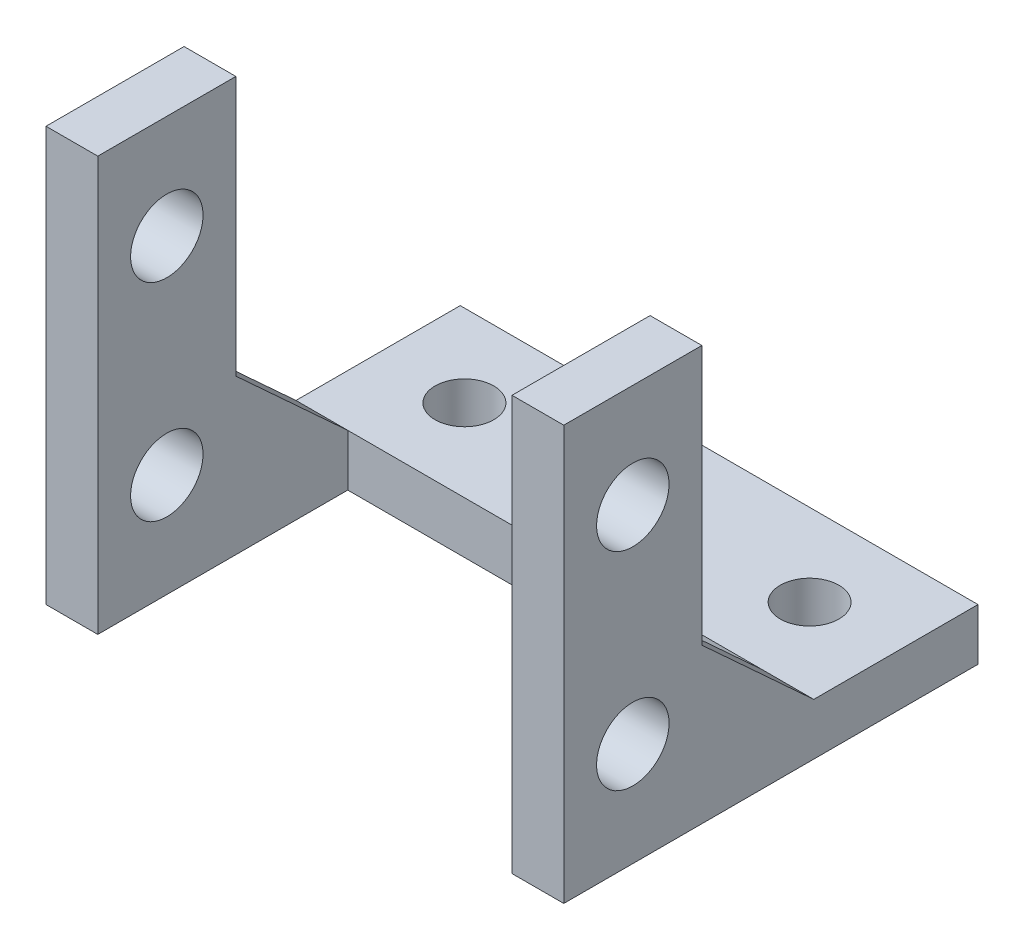
ISO-10303-21;
HEADER;
FILE_DESCRIPTION(('STEP AP214'),'2;1');
FILE_NAME('part.step','',(''),(''),'','','');
FILE_SCHEMA(('AUTOMOTIVE_DESIGN { 1 0 10303 214 1 1 1 1 }'));
ENDSEC;
DATA;
#1=APPLICATION_CONTEXT('core data for automotive mechanical design processes');
#2=APPLICATION_PROTOCOL_DEFINITION('international standard','automotive_design',2000,#1);
#3=PRODUCT_CONTEXT('',#1,'mechanical');
#4=PRODUCT('Part','Part','',(#3));
#5=PRODUCT_RELATED_PRODUCT_CATEGORY('part','',(#4));
#6=PRODUCT_DEFINITION_FORMATION('','',#4);
#7=PRODUCT_DEFINITION_CONTEXT('part definition',#1,'design');
#8=PRODUCT_DEFINITION('design','',#6,#7);
#9=PRODUCT_DEFINITION_SHAPE('','',#8);
#10=(LENGTH_UNIT() NAMED_UNIT(*) SI_UNIT(.MILLI.,.METRE.));
#11=(NAMED_UNIT(*) PLANE_ANGLE_UNIT() SI_UNIT($,.RADIAN.));
#12=(NAMED_UNIT(*) SI_UNIT($,.STERADIAN.) SOLID_ANGLE_UNIT());
#13=UNCERTAINTY_MEASURE_WITH_UNIT(LENGTH_MEASURE(1.E-05),#10,'distance_accuracy_value','');
#14=(GEOMETRIC_REPRESENTATION_CONTEXT(3) GLOBAL_UNCERTAINTY_ASSIGNED_CONTEXT((#13)) GLOBAL_UNIT_ASSIGNED_CONTEXT((#10,
#11,#12)) REPRESENTATION_CONTEXT('',''));
#15=CARTESIAN_POINT('',(0.,0.,0.));
#16=DIRECTION('',(0.,0.,1.));
#17=DIRECTION('',(1.,0.,0.));
#18=AXIS2_PLACEMENT_3D('',#15,#16,#17);
#19=CARTESIAN_POINT('',(15.,24.,0.));
#20=DIRECTION('',(0.,0.,-1.));
#21=DIRECTION('',(-1.,0.,0.));
#22=AXIS2_PLACEMENT_3D('',#19,#20,#21);
#23=PLANE('',#22);
#24=DIRECTION('',(-1.,0.,0.));
#25=VECTOR('',#24,1.);
#26=CARTESIAN_POINT('',(15.,24.,0.));
#27=LINE('',#26,#25);
#28=CARTESIAN_POINT('',(15.,24.,0.));
#29=VERTEX_POINT('',#28);
#30=CARTESIAN_POINT('',(12.,24.,0.));
#31=VERTEX_POINT('',#30);
#32=EDGE_CURVE('E160',#29,#31,#27,.T.);
#33=ORIENTED_EDGE('',*,*,#32,.T.);
#34=DIRECTION('',(0.,1.,0.));
#35=VECTOR('',#34,1.);
#36=CARTESIAN_POINT('',(12.,0.,0.));
#37=LINE('',#36,#35);
#38=CARTESIAN_POINT('',(12.,0.,0.));
#39=VERTEX_POINT('',#38);
#40=EDGE_CURVE('E274',#39,#31,#37,.T.);
#41=ORIENTED_EDGE('',*,*,#40,.F.);
#42=DIRECTION('',(-1.,0.,0.));
#43=VECTOR('',#42,1.);
#44=CARTESIAN_POINT('',(15.,0.,0.));
#45=LINE('',#44,#43);
#46=CARTESIAN_POINT('',(15.,0.,0.));
#47=VERTEX_POINT('',#46);
#48=EDGE_CURVE('E11',#47,#39,#45,.T.);
#49=ORIENTED_EDGE('',*,*,#48,.F.);
#50=DIRECTION('',(0.,-1.,0.));
#51=VECTOR('',#50,1.);
#52=CARTESIAN_POINT('',(15.,24.,0.));
#53=LINE('',#52,#51);
#54=EDGE_CURVE('E159',#29,#47,#53,.T.);
#55=ORIENTED_EDGE('',*,*,#54,.F.);
#56=EDGE_LOOP('',(#33,#41,#49,#55));
#57=FACE_BOUND('',#56,.T.);
#58=ADVANCED_FACE('F33',(#57),#23,.F.);
#59=CARTESIAN_POINT('',(15.,8.96093680674537,-8.));
#60=DIRECTION('',(0.,-0.736172141731038,0.676794339322617));
#61=DIRECTION('',(0.,-0.676794339322617,-0.736172141731038));
#62=AXIS2_PLACEMENT_3D('',#59,#60,#61);
#63=PLANE('',#62);
#64=DIRECTION('',(-1.,0.,0.));
#65=VECTOR('',#64,1.);
#66=CARTESIAN_POINT('',(15.,3.,-14.4839130010118));
#67=LINE('',#66,#65);
#68=CARTESIAN_POINT('',(15.,3.,-14.4839130010118));
#69=VERTEX_POINT('',#68);
#70=CARTESIAN_POINT('',(12.,3.,-14.4839130010118));
#71=VERTEX_POINT('',#70);
#72=EDGE_CURVE('E165',#69,#71,#67,.T.);
#73=ORIENTED_EDGE('',*,*,#72,.T.);
#74=DIRECTION('',(0.,0.676794339322617,0.736172141731038));
#75=VECTOR('',#74,1.);
#76=CARTESIAN_POINT('',(12.,8.96093680674537,-8.));
#77=LINE('',#76,#75);
#78=CARTESIAN_POINT('',(12.,8.96093680674537,-8.));
#79=VERTEX_POINT('',#78);
#80=EDGE_CURVE('E128',#71,#79,#77,.T.);
#81=ORIENTED_EDGE('',*,*,#80,.T.);
#82=DIRECTION('',(-1.,0.,0.));
#83=VECTOR('',#82,1.);
#84=CARTESIAN_POINT('',(15.,8.96093680674537,-8.));
#85=LINE('',#84,#83);
#86=CARTESIAN_POINT('',(15.,8.96093680674537,-8.));
#87=VERTEX_POINT('',#86);
#88=EDGE_CURVE('E125',#87,#79,#85,.T.);
#89=ORIENTED_EDGE('',*,*,#88,.F.);
#90=DIRECTION('',(0.,0.676794339322617,0.736172141731038));
#91=VECTOR('',#90,1.);
#92=CARTESIAN_POINT('',(15.,8.96093680674537,-8.));
#93=LINE('',#92,#91);
#94=EDGE_CURVE('E110',#69,#87,#93,.T.);
#95=ORIENTED_EDGE('',*,*,#94,.F.);
#96=EDGE_LOOP('',(#73,#81,#89,#95));
#97=FACE_BOUND('',#96,.T.);
#98=ADVANCED_FACE('F126',(#97),#63,.F.);
#99=CARTESIAN_POINT('',(15.,24.,-8.));
#100=DIRECTION('',(0.,0.,1.));
#101=DIRECTION('',(0.,-1.,0.));
#102=AXIS2_PLACEMENT_3D('',#99,#100,#101);
#103=PLANE('',#102);
#104=ORIENTED_EDGE('',*,*,#88,.T.);
#105=DIRECTION('',(0.,1.,0.));
#106=VECTOR('',#105,1.);
#107=CARTESIAN_POINT('',(12.,24.,-8.));
#108=LINE('',#107,#106);
#109=CARTESIAN_POINT('',(12.,24.,-8.));
#110=VERTEX_POINT('',#109);
#111=EDGE_CURVE('E209',#79,#110,#108,.T.);
#112=ORIENTED_EDGE('',*,*,#111,.T.);
#113=DIRECTION('',(-1.,0.,0.));
#114=VECTOR('',#113,1.);
#115=CARTESIAN_POINT('',(15.,24.,-8.));
#116=LINE('',#115,#114);
#117=CARTESIAN_POINT('',(15.,24.,-8.));
#118=VERTEX_POINT('',#117);
#119=EDGE_CURVE('E136',#118,#110,#116,.T.);
#120=ORIENTED_EDGE('',*,*,#119,.F.);
#121=DIRECTION('',(0.,1.,0.));
#122=VECTOR('',#121,1.);
#123=CARTESIAN_POINT('',(15.,24.,-8.));
#124=LINE('',#123,#122);
#125=EDGE_CURVE('E115',#87,#118,#124,.T.);
#126=ORIENTED_EDGE('',*,*,#125,.F.);
#127=EDGE_LOOP('',(#104,#112,#120,#126));
#128=FACE_BOUND('',#127,.T.);
#129=ADVANCED_FACE('F134',(#128),#103,.F.);
#130=CARTESIAN_POINT('',(15.,24.,-8.));
#131=DIRECTION('',(0.,-1.,0.));
#132=DIRECTION('',(0.,0.,-1.));
#133=AXIS2_PLACEMENT_3D('',#130,#131,#132);
#134=PLANE('',#133);
#135=ORIENTED_EDGE('',*,*,#119,.T.);
#136=DIRECTION('',(0.,0.,1.));
#137=VECTOR('',#136,1.);
#138=CARTESIAN_POINT('',(12.,24.,-14.4839130010118));
#139=LINE('',#138,#137);
#140=EDGE_CURVE('E198',#110,#31,#139,.T.);
#141=ORIENTED_EDGE('',*,*,#140,.T.);
#142=ORIENTED_EDGE('',*,*,#32,.F.);
#143=DIRECTION('',(0.,0.,1.));
#144=VECTOR('',#143,1.);
#145=CARTESIAN_POINT('',(15.,24.,-8.));
#146=LINE('',#145,#144);
#147=EDGE_CURVE('E59',#118,#29,#146,.T.);
#148=ORIENTED_EDGE('',*,*,#147,.F.);
#149=EDGE_LOOP('',(#135,#141,#142,#148));
#150=FACE_BOUND('',#149,.T.);
#151=ADVANCED_FACE('F335',(#150),#134,.F.);
#152=CARTESIAN_POINT('',(15.,6.,-4.));
#153=DIRECTION('',(-1.,0.,0.));
#154=DIRECTION('',(0.,0.,1.));
#155=AXIS2_PLACEMENT_3D('',#152,#153,#154);
#156=CYLINDRICAL_SURFACE('',#155,2.1);
#157=CARTESIAN_POINT('',(12.,6.,-4.));
#158=DIRECTION('',(1.,0.,0.));
#159=DIRECTION('',(0.,0.,-1.));
#160=AXIS2_PLACEMENT_3D('',#157,#158,#159);
#161=CIRCLE('',#160,2.1);
#162=CARTESIAN_POINT('',(12.,6.,-6.1));
#163=VERTEX_POINT('',#162);
#164=EDGE_CURVE('E206',#163,#163,#161,.T.);
#165=ORIENTED_EDGE('',*,*,#164,.F.);
#166=EDGE_LOOP('',(#165));
#167=FACE_BOUND('',#166,.T.);
#168=CARTESIAN_POINT('',(15.,6.,-4.));
#169=DIRECTION('',(1.,0.,0.));
#170=DIRECTION('',(0.,0.,-1.));
#171=AXIS2_PLACEMENT_3D('',#168,#169,#170);
#172=CIRCLE('',#171,2.1);
#173=CARTESIAN_POINT('',(15.,6.,-6.1));
#174=VERTEX_POINT('',#173);
#175=EDGE_CURVE('E144',#174,#174,#172,.T.);
#176=ORIENTED_EDGE('',*,*,#175,.T.);
#177=EDGE_LOOP('',(#176));
#178=FACE_BOUND('',#177,.T.);
#179=ADVANCED_FACE('F342',(#167,#178),#156,.F.);
#180=CARTESIAN_POINT('',(15.,18.,-4.));
#181=DIRECTION('',(-1.,0.,0.));
#182=DIRECTION('',(0.,0.,1.));
#183=AXIS2_PLACEMENT_3D('',#180,#181,#182);
#184=CYLINDRICAL_SURFACE('',#183,2.1);
#185=CARTESIAN_POINT('',(12.,18.,-4.));
#186=DIRECTION('',(1.,0.,0.));
#187=DIRECTION('',(0.,0.,-1.));
#188=AXIS2_PLACEMENT_3D('',#185,#186,#187);
#189=CIRCLE('',#188,2.1);
#190=CARTESIAN_POINT('',(12.,18.,-6.1));
#191=VERTEX_POINT('',#190);
#192=EDGE_CURVE('E37',#191,#191,#189,.T.);
#193=ORIENTED_EDGE('',*,*,#192,.F.);
#194=EDGE_LOOP('',(#193));
#195=FACE_BOUND('',#194,.T.);
#196=CARTESIAN_POINT('',(15.,18.,-4.));
#197=DIRECTION('',(1.,0.,0.));
#198=DIRECTION('',(0.,0.,1.));
#199=AXIS2_PLACEMENT_3D('',#196,#197,#198);
#200=CIRCLE('',#199,2.1);
#201=CARTESIAN_POINT('',(15.,18.,-1.9));
#202=VERTEX_POINT('',#201);
#203=EDGE_CURVE('E213',#202,#202,#200,.T.);
#204=ORIENTED_EDGE('',*,*,#203,.T.);
#205=EDGE_LOOP('',(#204));
#206=FACE_BOUND('',#205,.T.);
#207=ADVANCED_FACE('F350',(#195,#206),#184,.F.);
#208=CARTESIAN_POINT('',(15.,0.,0.));
#209=DIRECTION('',(1.,0.,0.));
#210=DIRECTION('',(0.,0.,-1.));
#211=AXIS2_PLACEMENT_3D('',#208,#209,#210);
#212=PLANE('',#211);
#213=ORIENTED_EDGE('',*,*,#175,.F.);
#214=EDGE_LOOP('',(#213));
#215=FACE_BOUND('',#214,.T.);
#216=ORIENTED_EDGE('',*,*,#54,.T.);
#217=DIRECTION('',(0.,0.,-1.));
#218=VECTOR('',#217,1.);
#219=CARTESIAN_POINT('',(15.,0.,0.));
#220=LINE('',#219,#218);
#221=CARTESIAN_POINT('',(15.,0.,-24.));
#222=VERTEX_POINT('',#221);
#223=EDGE_CURVE('E98',#47,#222,#220,.T.);
#224=ORIENTED_EDGE('',*,*,#223,.T.);
#225=DIRECTION('',(0.,1.,0.));
#226=VECTOR('',#225,1.);
#227=CARTESIAN_POINT('',(15.,0.,-24.));
#228=LINE('',#227,#226);
#229=CARTESIAN_POINT('',(15.,3.,-24.));
#230=VERTEX_POINT('',#229);
#231=EDGE_CURVE('E225',#222,#230,#228,.T.);
#232=ORIENTED_EDGE('',*,*,#231,.T.);
#233=DIRECTION('',(0.,0.,1.));
#234=VECTOR('',#233,1.);
#235=CARTESIAN_POINT('',(15.,3.,-14.4839130010118));
#236=LINE('',#235,#234);
#237=EDGE_CURVE('E118',#230,#69,#236,.T.);
#238=ORIENTED_EDGE('',*,*,#237,.T.);
#239=ORIENTED_EDGE('',*,*,#94,.T.);
#240=ORIENTED_EDGE('',*,*,#125,.T.);
#241=ORIENTED_EDGE('',*,*,#147,.T.);
#242=EDGE_LOOP('',(#216,#224,#232,#238,#239,#240,#241));
#243=FACE_BOUND('',#242,.T.);
#244=ORIENTED_EDGE('',*,*,#203,.F.);
#245=EDGE_LOOP('',(#244));
#246=FACE_BOUND('',#245,.T.);
#247=ADVANCED_FACE('F112',(#215,#243,#246),#212,.T.);
#248=CARTESIAN_POINT('',(-15.,0.,0.));
#249=DIRECTION('',(1.,0.,0.));
#250=DIRECTION('',(0.,0.,-1.));
#251=AXIS2_PLACEMENT_3D('',#248,#249,#250);
#252=PLANE('',#251);
#253=DIRECTION('',(0.,-1.,0.));
#254=VECTOR('',#253,1.);
#255=CARTESIAN_POINT('',(-15.,24.,0.));
#256=LINE('',#255,#254);
#257=CARTESIAN_POINT('',(-15.,24.,0.));
#258=VERTEX_POINT('',#257);
#259=CARTESIAN_POINT('',(-15.,0.,0.));
#260=VERTEX_POINT('',#259);
#261=EDGE_CURVE('E141',#258,#260,#256,.T.);
#262=ORIENTED_EDGE('',*,*,#261,.F.);
#263=DIRECTION('',(0.,0.,1.));
#264=VECTOR('',#263,1.);
#265=CARTESIAN_POINT('',(-15.,24.,-8.));
#266=LINE('',#265,#264);
#267=CARTESIAN_POINT('',(-15.,24.,-8.));
#268=VERTEX_POINT('',#267);
#269=EDGE_CURVE('E157',#268,#258,#266,.T.);
#270=ORIENTED_EDGE('',*,*,#269,.F.);
#271=DIRECTION('',(0.,1.,0.));
#272=VECTOR('',#271,1.);
#273=CARTESIAN_POINT('',(-15.,24.,-8.));
#274=LINE('',#273,#272);
#275=CARTESIAN_POINT('',(-15.,8.96093680674537,-8.));
#276=VERTEX_POINT('',#275);
#277=EDGE_CURVE('E154',#276,#268,#274,.T.);
#278=ORIENTED_EDGE('',*,*,#277,.F.);
#279=DIRECTION('',(0.,0.676794339322617,0.736172141731038));
#280=VECTOR('',#279,1.);
#281=CARTESIAN_POINT('',(-15.,8.96093680674537,-8.));
#282=LINE('',#281,#280);
#283=CARTESIAN_POINT('',(-15.,3.,-14.4839130010118));
#284=VERTEX_POINT('',#283);
#285=EDGE_CURVE('E151',#284,#276,#282,.T.);
#286=ORIENTED_EDGE('',*,*,#285,.F.);
#287=DIRECTION('',(0.,0.,1.));
#288=VECTOR('',#287,1.);
#289=CARTESIAN_POINT('',(-15.,3.,-14.4839130010118));
#290=LINE('',#289,#288);
#291=CARTESIAN_POINT('',(-15.,3.,-24.));
#292=VERTEX_POINT('',#291);
#293=EDGE_CURVE('E148',#292,#284,#290,.T.);
#294=ORIENTED_EDGE('',*,*,#293,.F.);
#295=DIRECTION('',(0.,1.,0.));
#296=VECTOR('',#295,1.);
#297=CARTESIAN_POINT('',(-15.,0.,-24.));
#298=LINE('',#297,#296);
#299=CARTESIAN_POINT('',(-15.,0.,-24.));
#300=VERTEX_POINT('',#299);
#301=EDGE_CURVE('E146',#300,#292,#298,.T.);
#302=ORIENTED_EDGE('',*,*,#301,.F.);
#303=DIRECTION('',(0.,0.,-1.));
#304=VECTOR('',#303,1.);
#305=CARTESIAN_POINT('',(-15.,0.,0.));
#306=LINE('',#305,#304);
#307=EDGE_CURVE('E143',#260,#300,#306,.T.);
#308=ORIENTED_EDGE('',*,*,#307,.F.);
#309=EDGE_LOOP('',(#262,#270,#278,#286,#294,#302,#308));
#310=FACE_BOUND('',#309,.T.);
#311=CARTESIAN_POINT('',(-15.,6.,-4.));
#312=DIRECTION('',(1.,0.,0.));
#313=DIRECTION('',(0.,0.,-1.));
#314=AXIS2_PLACEMENT_3D('',#311,#312,#313);
#315=CIRCLE('',#314,2.1);
#316=CARTESIAN_POINT('',(-15.,6.,-6.1));
#317=VERTEX_POINT('',#316);
#318=EDGE_CURVE('E216',#317,#317,#315,.T.);
#319=ORIENTED_EDGE('',*,*,#318,.T.);
#320=EDGE_LOOP('',(#319));
#321=FACE_BOUND('',#320,.T.);
#322=CARTESIAN_POINT('',(-15.,18.,-4.));
#323=DIRECTION('',(1.,0.,0.));
#324=DIRECTION('',(0.,0.,1.));
#325=AXIS2_PLACEMENT_3D('',#322,#323,#324);
#326=CIRCLE('',#325,2.1);
#327=CARTESIAN_POINT('',(-15.,18.,-1.9));
#328=VERTEX_POINT('',#327);
#329=EDGE_CURVE('E212',#328,#328,#326,.T.);
#330=ORIENTED_EDGE('',*,*,#329,.T.);
#331=EDGE_LOOP('',(#330));
#332=FACE_BOUND('',#331,.T.);
#333=ADVANCED_FACE('F312',(#310,#321,#332),#252,.F.);
#334=CARTESIAN_POINT('',(-12.,0.,0.));
#335=VERTEX_POINT('',#334);
#336=EDGE_CURVE('E42',#335,#260,#45,.T.);
#337=ORIENTED_EDGE('',*,*,#336,.F.);
#338=DIRECTION('',(0.,-1.,0.));
#339=VECTOR('',#338,1.);
#340=CARTESIAN_POINT('',(-12.,0.,0.));
#341=LINE('',#340,#339);
#342=CARTESIAN_POINT('',(-12.,24.,0.));
#343=VERTEX_POINT('',#342);
#344=EDGE_CURVE('E194',#343,#335,#341,.T.);
#345=ORIENTED_EDGE('',*,*,#344,.F.);
#346=EDGE_CURVE('E90',#343,#258,#27,.T.);
#347=ORIENTED_EDGE('',*,*,#346,.T.);
#348=ORIENTED_EDGE('',*,*,#261,.T.);
#349=EDGE_LOOP('',(#337,#345,#347,#348));
#350=FACE_BOUND('',#349,.T.);
#351=ADVANCED_FACE('F35',(#350),#23,.F.);
#352=CARTESIAN_POINT('',(15.,0.,0.));
#353=DIRECTION('',(0.,1.,0.));
#354=DIRECTION('',(0.,0.,1.));
#355=AXIS2_PLACEMENT_3D('',#352,#353,#354);
#356=PLANE('',#355);
#357=CARTESIAN_POINT('',(-10.,0.,-19.2419565005059));
#358=DIRECTION('',(0.,1.,0.));
#359=DIRECTION('',(0.,0.,1.));
#360=AXIS2_PLACEMENT_3D('',#357,#358,#359);
#361=CIRCLE('',#360,1.7);
#362=CARTESIAN_POINT('',(-10.,0.,-17.5419565005059));
#363=VERTEX_POINT('',#362);
#364=EDGE_CURVE('E275',#363,#363,#361,.T.);
#365=ORIENTED_EDGE('',*,*,#364,.T.);
#366=EDGE_LOOP('',(#365));
#367=FACE_BOUND('',#366,.T.);
#368=CARTESIAN_POINT('',(10.,0.,-19.2419565005059));
#369=DIRECTION('',(0.,1.,0.));
#370=DIRECTION('',(0.,0.,-1.));
#371=AXIS2_PLACEMENT_3D('',#368,#369,#370);
#372=CIRCLE('',#371,1.7);
#373=CARTESIAN_POINT('',(10.,0.,-20.9419565005059));
#374=VERTEX_POINT('',#373);
#375=EDGE_CURVE('E282',#374,#374,#372,.T.);
#376=ORIENTED_EDGE('',*,*,#375,.T.);
#377=EDGE_LOOP('',(#376));
#378=FACE_BOUND('',#377,.T.);
#379=ORIENTED_EDGE('',*,*,#48,.T.);
#380=DIRECTION('',(0.,0.,1.));
#381=VECTOR('',#380,1.);
#382=CARTESIAN_POINT('',(12.,0.,-14.4839130010118));
#383=LINE('',#382,#381);
#384=CARTESIAN_POINT('',(12.,0.,-14.4839130010118));
#385=VERTEX_POINT('',#384);
#386=EDGE_CURVE('E176',#385,#39,#383,.T.);
#387=ORIENTED_EDGE('',*,*,#386,.F.);
#388=DIRECTION('',(1.,0.,0.));
#389=VECTOR('',#388,1.);
#390=CARTESIAN_POINT('',(-12.,0.,-14.4839130010118));
#391=LINE('',#390,#389);
#392=CARTESIAN_POINT('',(-12.,0.,-14.4839130010118));
#393=VERTEX_POINT('',#392);
#394=EDGE_CURVE('E200',#393,#385,#391,.T.);
#395=ORIENTED_EDGE('',*,*,#394,.F.);
#396=DIRECTION('',(0.,0.,1.));
#397=VECTOR('',#396,1.);
#398=CARTESIAN_POINT('',(-12.,0.,-14.4839130010118));
#399=LINE('',#398,#397);
#400=EDGE_CURVE('E182',#393,#335,#399,.T.);
#401=ORIENTED_EDGE('',*,*,#400,.T.);
#402=ORIENTED_EDGE('',*,*,#336,.T.);
#403=ORIENTED_EDGE('',*,*,#307,.T.);
#404=DIRECTION('',(-1.,0.,0.));
#405=VECTOR('',#404,1.);
#406=CARTESIAN_POINT('',(15.,0.,-24.));
#407=LINE('',#406,#405);
#408=EDGE_CURVE('E171',#222,#300,#407,.T.);
#409=ORIENTED_EDGE('',*,*,#408,.F.);
#410=ORIENTED_EDGE('',*,*,#223,.F.);
#411=EDGE_LOOP('',(#379,#387,#395,#401,#402,#403,#409,#410));
#412=FACE_BOUND('',#411,.T.);
#413=ADVANCED_FACE('F271',(#367,#378,#412),#356,.F.);
#414=CARTESIAN_POINT('',(15.,0.,-24.));
#415=DIRECTION('',(0.,0.,1.));
#416=DIRECTION('',(1.,0.,0.));
#417=AXIS2_PLACEMENT_3D('',#414,#415,#416);
#418=PLANE('',#417);
#419=ORIENTED_EDGE('',*,*,#301,.T.);
#420=DIRECTION('',(-1.,0.,0.));
#421=VECTOR('',#420,1.);
#422=CARTESIAN_POINT('',(15.,3.,-24.));
#423=LINE('',#422,#421);
#424=EDGE_CURVE('E167',#230,#292,#423,.T.);
#425=ORIENTED_EDGE('',*,*,#424,.F.);
#426=ORIENTED_EDGE('',*,*,#231,.F.);
#427=ORIENTED_EDGE('',*,*,#408,.T.);
#428=EDGE_LOOP('',(#419,#425,#426,#427));
#429=FACE_BOUND('',#428,.T.);
#430=ADVANCED_FACE('F229',(#429),#418,.F.);
#431=CARTESIAN_POINT('',(15.,3.,-14.4839130010118));
#432=DIRECTION('',(0.,-1.,0.));
#433=DIRECTION('',(0.,0.,-1.));
#434=AXIS2_PLACEMENT_3D('',#431,#432,#433);
#435=PLANE('',#434);
#436=CARTESIAN_POINT('',(-10.,3.,-19.2419565005059));
#437=DIRECTION('',(0.,-1.,0.));
#438=DIRECTION('',(0.,0.,-1.));
#439=AXIS2_PLACEMENT_3D('',#436,#437,#438);
#440=CIRCLE('',#439,1.7);
#441=CARTESIAN_POINT('',(-10.,3.,-20.9419565005059));
#442=VERTEX_POINT('',#441);
#443=EDGE_CURVE('E277',#442,#442,#440,.T.);
#444=ORIENTED_EDGE('',*,*,#443,.T.);
#445=EDGE_LOOP('',(#444));
#446=FACE_BOUND('',#445,.T.);
#447=CARTESIAN_POINT('',(10.,3.,-19.2419565005059));
#448=DIRECTION('',(0.,-1.,0.));
#449=DIRECTION('',(0.,0.,-1.));
#450=AXIS2_PLACEMENT_3D('',#447,#448,#449);
#451=CIRCLE('',#450,1.7);
#452=CARTESIAN_POINT('',(10.,3.,-20.9419565005059));
#453=VERTEX_POINT('',#452);
#454=EDGE_CURVE('E287',#453,#453,#451,.T.);
#455=ORIENTED_EDGE('',*,*,#454,.T.);
#456=EDGE_LOOP('',(#455));
#457=FACE_BOUND('',#456,.T.);
#458=ORIENTED_EDGE('',*,*,#293,.T.);
#459=CARTESIAN_POINT('',(-12.,3.,-14.4839130010118));
#460=VERTEX_POINT('',#459);
#461=EDGE_CURVE('E131',#460,#284,#67,.T.);
#462=ORIENTED_EDGE('',*,*,#461,.F.);
#463=EDGE_CURVE('E168',#71,#460,#67,.T.);
#464=ORIENTED_EDGE('',*,*,#463,.F.);
#465=ORIENTED_EDGE('',*,*,#72,.F.);
#466=ORIENTED_EDGE('',*,*,#237,.F.);
#467=ORIENTED_EDGE('',*,*,#424,.T.);
#468=EDGE_LOOP('',(#458,#462,#464,#465,#466,#467));
#469=FACE_BOUND('',#468,.T.);
#470=ADVANCED_FACE('F233',(#446,#457,#469),#435,.F.);
#471=CARTESIAN_POINT('',(-12.,8.96093680674537,-8.));
#472=VERTEX_POINT('',#471);
#473=EDGE_CURVE('E132',#472,#276,#85,.T.);
#474=ORIENTED_EDGE('',*,*,#473,.F.);
#475=DIRECTION('',(0.,-0.676794339322617,-0.736172141731038));
#476=VECTOR('',#475,1.);
#477=CARTESIAN_POINT('',(-12.,8.96093680674537,-8.));
#478=LINE('',#477,#476);
#479=EDGE_CURVE('E203',#472,#460,#478,.T.);
#480=ORIENTED_EDGE('',*,*,#479,.T.);
#481=ORIENTED_EDGE('',*,*,#461,.T.);
#482=ORIENTED_EDGE('',*,*,#285,.T.);
#483=EDGE_LOOP('',(#474,#480,#481,#482));
#484=FACE_BOUND('',#483,.T.);
#485=ADVANCED_FACE('F310',(#484),#63,.F.);
#486=CARTESIAN_POINT('',(-12.,24.,-8.));
#487=VERTEX_POINT('',#486);
#488=EDGE_CURVE('E163',#487,#268,#116,.T.);
#489=ORIENTED_EDGE('',*,*,#488,.F.);
#490=DIRECTION('',(0.,-1.,0.));
#491=VECTOR('',#490,1.);
#492=CARTESIAN_POINT('',(-12.,24.,-8.));
#493=LINE('',#492,#491);
#494=EDGE_CURVE('E50',#487,#472,#493,.T.);
#495=ORIENTED_EDGE('',*,*,#494,.T.);
#496=ORIENTED_EDGE('',*,*,#473,.T.);
#497=ORIENTED_EDGE('',*,*,#277,.T.);
#498=EDGE_LOOP('',(#489,#495,#496,#497));
#499=FACE_BOUND('',#498,.T.);
#500=ADVANCED_FACE('F329',(#499),#103,.F.);
#501=ORIENTED_EDGE('',*,*,#346,.F.);
#502=DIRECTION('',(0.,0.,1.));
#503=VECTOR('',#502,1.);
#504=CARTESIAN_POINT('',(-12.,24.,-14.4839130010118));
#505=LINE('',#504,#503);
#506=EDGE_CURVE('E191',#487,#343,#505,.T.);
#507=ORIENTED_EDGE('',*,*,#506,.F.);
#508=ORIENTED_EDGE('',*,*,#488,.T.);
#509=ORIENTED_EDGE('',*,*,#269,.T.);
#510=EDGE_LOOP('',(#501,#507,#508,#509));
#511=FACE_BOUND('',#510,.T.);
#512=ADVANCED_FACE('F331',(#511),#134,.F.);
#513=CARTESIAN_POINT('',(-12.,6.,-4.));
#514=DIRECTION('',(-1.,0.,0.));
#515=DIRECTION('',(0.,0.,1.));
#516=AXIS2_PLACEMENT_3D('',#513,#514,#515);
#517=CIRCLE('',#516,2.1);
#518=CARTESIAN_POINT('',(-12.,6.,-1.9));
#519=VERTEX_POINT('',#518);
#520=EDGE_CURVE('E175',#519,#519,#517,.T.);
#521=ORIENTED_EDGE('',*,*,#520,.F.);
#522=EDGE_LOOP('',(#521));
#523=FACE_BOUND('',#522,.T.);
#524=ORIENTED_EDGE('',*,*,#318,.F.);
#525=EDGE_LOOP('',(#524));
#526=FACE_BOUND('',#525,.T.);
#527=ADVANCED_FACE('F333',(#523,#526),#156,.F.);
#528=CARTESIAN_POINT('',(-12.,18.,-4.));
#529=DIRECTION('',(-1.,0.,0.));
#530=DIRECTION('',(0.,0.,1.));
#531=AXIS2_PLACEMENT_3D('',#528,#529,#530);
#532=CIRCLE('',#531,2.1);
#533=CARTESIAN_POINT('',(-12.,18.,-1.9));
#534=VERTEX_POINT('',#533);
#535=EDGE_CURVE('E173',#534,#534,#532,.T.);
#536=ORIENTED_EDGE('',*,*,#535,.F.);
#537=EDGE_LOOP('',(#536));
#538=FACE_BOUND('',#537,.T.);
#539=ORIENTED_EDGE('',*,*,#329,.F.);
#540=EDGE_LOOP('',(#539));
#541=FACE_BOUND('',#540,.T.);
#542=ADVANCED_FACE('F300',(#538,#541),#184,.F.);
#543=CARTESIAN_POINT('',(0.,0.,-14.4839130010118));
#544=DIRECTION('',(0.,0.,-1.));
#545=DIRECTION('',(-1.,0.,0.));
#546=AXIS2_PLACEMENT_3D('',#543,#544,#545);
#547=PLANE('',#546);
#548=DIRECTION('',(0.,-1.,0.));
#549=VECTOR('',#548,1.);
#550=CARTESIAN_POINT('',(-12.,0.,-14.4839130010118));
#551=LINE('',#550,#549);
#552=EDGE_CURVE('E263',#460,#393,#551,.T.);
#553=ORIENTED_EDGE('',*,*,#552,.T.);
#554=ORIENTED_EDGE('',*,*,#394,.T.);
#555=DIRECTION('',(0.,1.,0.));
#556=VECTOR('',#555,1.);
#557=CARTESIAN_POINT('',(12.,0.,-14.4839130010118));
#558=LINE('',#557,#556);
#559=EDGE_CURVE('E267',#385,#71,#558,.T.);
#560=ORIENTED_EDGE('',*,*,#559,.T.);
#561=ORIENTED_EDGE('',*,*,#463,.T.);
#562=EDGE_LOOP('',(#553,#554,#560,#561));
#563=FACE_BOUND('',#562,.T.);
#564=ADVANCED_FACE('F265',(#563),#547,.F.);
#565=CARTESIAN_POINT('',(12.,0.,-14.4839130010118));
#566=DIRECTION('',(1.,0.,0.));
#567=DIRECTION('',(0.,0.,-1.));
#568=AXIS2_PLACEMENT_3D('',#565,#566,#567);
#569=PLANE('',#568);
#570=ORIENTED_EDGE('',*,*,#164,.T.);
#571=EDGE_LOOP('',(#570));
#572=FACE_BOUND('',#571,.T.);
#573=ORIENTED_EDGE('',*,*,#192,.T.);
#574=EDGE_LOOP('',(#573));
#575=FACE_BOUND('',#574,.T.);
#576=ORIENTED_EDGE('',*,*,#559,.F.);
#577=ORIENTED_EDGE('',*,*,#386,.T.);
#578=ORIENTED_EDGE('',*,*,#40,.T.);
#579=ORIENTED_EDGE('',*,*,#140,.F.);
#580=ORIENTED_EDGE('',*,*,#111,.F.);
#581=ORIENTED_EDGE('',*,*,#80,.F.);
#582=EDGE_LOOP('',(#576,#577,#578,#579,#580,#581));
#583=FACE_BOUND('',#582,.T.);
#584=ADVANCED_FACE('F289',(#572,#575,#583),#569,.F.);
#585=CARTESIAN_POINT('',(-12.,0.,-14.4839130010118));
#586=DIRECTION('',(-1.,0.,0.));
#587=DIRECTION('',(0.,0.,1.));
#588=AXIS2_PLACEMENT_3D('',#585,#586,#587);
#589=PLANE('',#588);
#590=ORIENTED_EDGE('',*,*,#520,.T.);
#591=EDGE_LOOP('',(#590));
#592=FACE_BOUND('',#591,.T.);
#593=ORIENTED_EDGE('',*,*,#535,.T.);
#594=EDGE_LOOP('',(#593));
#595=FACE_BOUND('',#594,.T.);
#596=ORIENTED_EDGE('',*,*,#494,.F.);
#597=ORIENTED_EDGE('',*,*,#506,.T.);
#598=ORIENTED_EDGE('',*,*,#344,.T.);
#599=ORIENTED_EDGE('',*,*,#400,.F.);
#600=ORIENTED_EDGE('',*,*,#552,.F.);
#601=ORIENTED_EDGE('',*,*,#479,.F.);
#602=EDGE_LOOP('',(#596,#597,#598,#599,#600,#601));
#603=FACE_BOUND('',#602,.T.);
#604=ADVANCED_FACE('F269',(#592,#595,#603),#589,.F.);
#605=CARTESIAN_POINT('',(10.,24.001,-19.2419565005059));
#606=DIRECTION('',(0.,-1.,0.));
#607=DIRECTION('',(0.,0.,-1.));
#608=AXIS2_PLACEMENT_3D('',#605,#606,#607);
#609=CYLINDRICAL_SURFACE('',#608,1.7);
#610=ORIENTED_EDGE('',*,*,#375,.F.);
#611=EDGE_LOOP('',(#610));
#612=FACE_BOUND('',#611,.T.);
#613=ORIENTED_EDGE('',*,*,#454,.F.);
#614=EDGE_LOOP('',(#613));
#615=FACE_BOUND('',#614,.T.);
#616=ADVANCED_FACE('F297',(#612,#615),#609,.F.);
#617=CARTESIAN_POINT('',(-10.,24.001,-19.2419565005059));
#618=DIRECTION('',(0.,-1.,0.));
#619=DIRECTION('',(0.,0.,-1.));
#620=AXIS2_PLACEMENT_3D('',#617,#618,#619);
#621=CYLINDRICAL_SURFACE('',#620,1.7);
#622=ORIENTED_EDGE('',*,*,#364,.F.);
#623=EDGE_LOOP('',(#622));
#624=FACE_BOUND('',#623,.T.);
#625=ORIENTED_EDGE('',*,*,#443,.F.);
#626=EDGE_LOOP('',(#625));
#627=FACE_BOUND('',#626,.T.);
#628=ADVANCED_FACE('F488',(#624,#627),#621,.F.);
#629=CLOSED_SHELL('',(#58,#98,#129,#151,#179,#207,#247,#333,#351,#413,#430,#470,#485,#500,#512,
#527,#542,#564,#584,#604,#616,#628));
#630=MANIFOLD_SOLID_BREP('B2',#629);
#631=ADVANCED_BREP_SHAPE_REPRESENTATION('',(#18,#630),#14);
#632=SHAPE_DEFINITION_REPRESENTATION(#9,#631);
ENDSEC;
END-ISO-10303-21;
